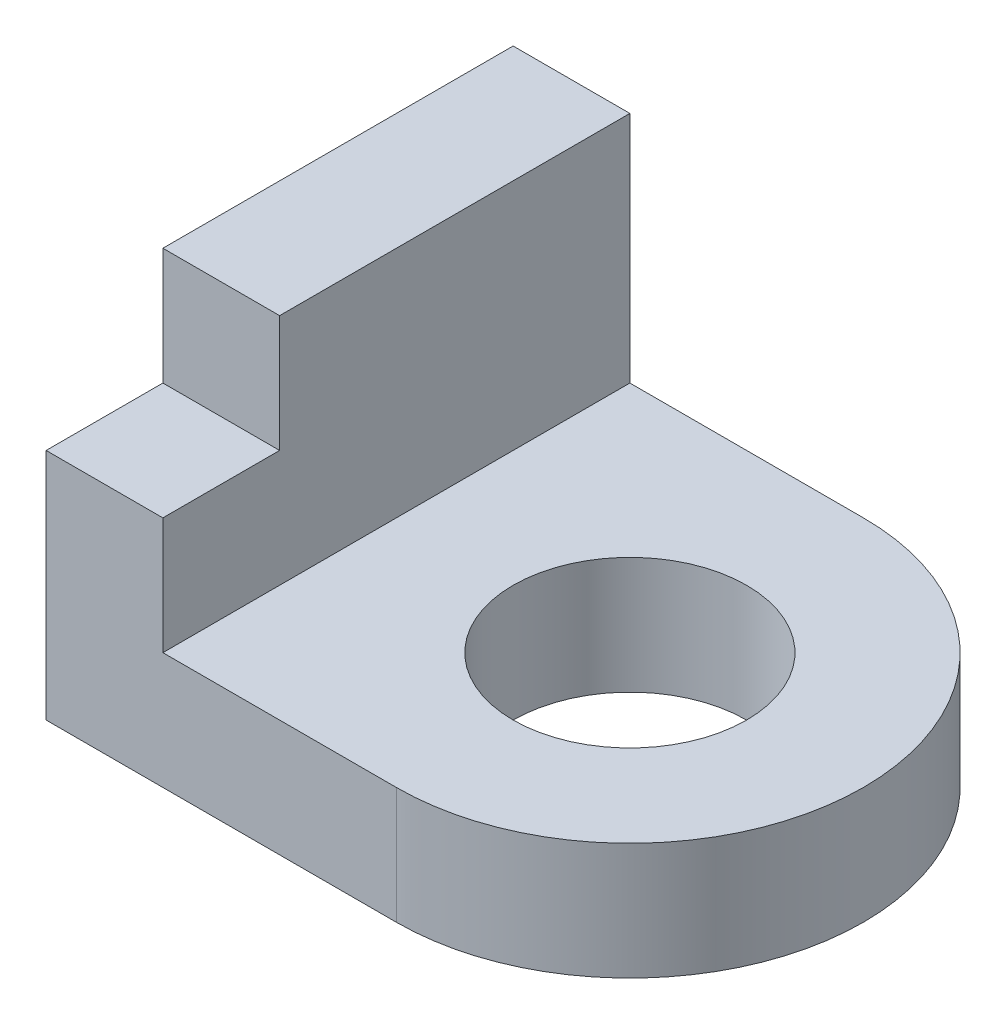
ISO-10303-21;
HEADER;
FILE_DESCRIPTION(('STEP AP214'),'2;1');
FILE_NAME('part.step','',(''),(''),'','','');
FILE_SCHEMA(('AUTOMOTIVE_DESIGN { 1 0 10303 214 1 1 1 1 }'));
ENDSEC;
DATA;
#1=APPLICATION_CONTEXT('core data for automotive mechanical design processes');
#2=APPLICATION_PROTOCOL_DEFINITION('international standard','automotive_design',2000,#1);
#3=PRODUCT_CONTEXT('',#1,'mechanical');
#4=PRODUCT('Part','Part','',(#3));
#5=PRODUCT_RELATED_PRODUCT_CATEGORY('part','',(#4));
#6=PRODUCT_DEFINITION_FORMATION('','',#4);
#7=PRODUCT_DEFINITION_CONTEXT('part definition',#1,'design');
#8=PRODUCT_DEFINITION('design','',#6,#7);
#9=PRODUCT_DEFINITION_SHAPE('','',#8);
#10=(LENGTH_UNIT() NAMED_UNIT(*) SI_UNIT(.MILLI.,.METRE.));
#11=(NAMED_UNIT(*) PLANE_ANGLE_UNIT() SI_UNIT($,.RADIAN.));
#12=(NAMED_UNIT(*) SI_UNIT($,.STERADIAN.) SOLID_ANGLE_UNIT());
#13=UNCERTAINTY_MEASURE_WITH_UNIT(LENGTH_MEASURE(1.E-05),#10,'distance_accuracy_value','');
#14=(GEOMETRIC_REPRESENTATION_CONTEXT(3) GLOBAL_UNCERTAINTY_ASSIGNED_CONTEXT((#13)) GLOBAL_UNIT_ASSIGNED_CONTEXT((#10,
#11,#12)) REPRESENTATION_CONTEXT('',''));
#15=CARTESIAN_POINT('',(0.,0.,0.));
#16=DIRECTION('',(0.,0.,1.));
#17=DIRECTION('',(1.,0.,0.));
#18=AXIS2_PLACEMENT_3D('',#15,#16,#17);
#19=CARTESIAN_POINT('',(-5.44977358018115,4.8065547779606,1.72901678330591));
#20=DIRECTION('',(0.,0.,1.));
#21=DIRECTION('',(1.,0.,0.));
#22=AXIS2_PLACEMENT_3D('',#19,#20,#21);
#23=PLANE('',#22);
#24=DIRECTION('',(-1.,0.,0.));
#25=VECTOR('',#24,1.);
#26=CARTESIAN_POINT('',(-5.44977358018115,3.8065547779606,1.72901678330591));
#27=LINE('',#26,#25);
#28=CARTESIAN_POINT('',(-5.44977358018115,3.8065547779606,1.72901678330591));
#29=VERTEX_POINT('',#28);
#30=CARTESIAN_POINT('',(-8.44977358018114,3.8065547779606,1.72901678330591));
#31=VERTEX_POINT('',#30);
#32=EDGE_CURVE('E111',#29,#31,#27,.T.);
#33=ORIENTED_EDGE('',*,*,#32,.F.);
#34=DIRECTION('',(0.,-1.,0.));
#35=VECTOR('',#34,1.);
#36=CARTESIAN_POINT('',(-5.44977358018115,4.8065547779606,1.72901678330591));
#37=LINE('',#36,#35);
#38=CARTESIAN_POINT('',(-5.44977358018115,4.8065547779606,1.72901678330591));
#39=VERTEX_POINT('',#38);
#40=EDGE_CURVE('E11',#39,#29,#37,.T.);
#41=ORIENTED_EDGE('',*,*,#40,.F.);
#42=DIRECTION('',(-1.,0.,0.));
#43=VECTOR('',#42,1.);
#44=CARTESIAN_POINT('',(-5.44977358018115,4.8065547779606,1.72901678330591));
#45=LINE('',#44,#43);
#46=CARTESIAN_POINT('',(-7.44977358018115,4.8065547779606,1.72901678330591));
#47=VERTEX_POINT('',#46);
#48=EDGE_CURVE('E101',#39,#47,#45,.T.);
#49=ORIENTED_EDGE('',*,*,#48,.T.);
#50=DIRECTION('',(0.,-1.,0.));
#51=VECTOR('',#50,1.);
#52=CARTESIAN_POINT('',(-7.44977358018115,5.8065547779606,1.72901678330591));
#53=LINE('',#52,#51);
#54=CARTESIAN_POINT('',(-7.44977358018115,5.8065547779606,1.72901678330591));
#55=VERTEX_POINT('',#54);
#56=EDGE_CURVE('E115',#55,#47,#53,.T.);
#57=ORIENTED_EDGE('',*,*,#56,.F.);
#58=DIRECTION('',(-1.,0.,0.));
#59=VECTOR('',#58,1.);
#60=CARTESIAN_POINT('',(-5.44977358018115,5.8065547779606,1.72901678330591));
#61=LINE('',#60,#59);
#62=CARTESIAN_POINT('',(-8.44977358018114,5.8065547779606,1.72901678330591));
#63=VERTEX_POINT('',#62);
#64=EDGE_CURVE('E128',#55,#63,#61,.T.);
#65=ORIENTED_EDGE('',*,*,#64,.T.);
#66=DIRECTION('',(0.,-1.,0.));
#67=VECTOR('',#66,1.);
#68=CARTESIAN_POINT('',(-8.44977358018114,5.8065547779606,1.72901678330591));
#69=LINE('',#68,#67);
#70=EDGE_CURVE('E122',#63,#31,#69,.T.);
#71=ORIENTED_EDGE('',*,*,#70,.T.);
#72=EDGE_LOOP('',(#33,#41,#49,#57,#65,#71));
#73=FACE_BOUND('',#72,.T.);
#74=ADVANCED_FACE('F38',(#73),#23,.T.);
#75=CARTESIAN_POINT('',(-5.44977358018115,4.8065547779606,-0.27098321669409));
#76=DIRECTION('',(0.,-1.,0.));
#77=DIRECTION('',(0.,0.,-1.));
#78=AXIS2_PLACEMENT_3D('',#75,#76,#77);
#79=CYLINDRICAL_SURFACE('',#78,2.);
#80=CARTESIAN_POINT('',(-5.44977358018115,3.8065547779606,-0.27098321669409));
#81=DIRECTION('',(0.,1.,0.));
#82=DIRECTION('',(0.,0.,1.));
#83=AXIS2_PLACEMENT_3D('',#80,#81,#82);
#84=CIRCLE('',#83,2.);
#85=CARTESIAN_POINT('',(-5.44977358018115,3.8065547779606,-2.27098321669409));
#86=VERTEX_POINT('',#85);
#87=EDGE_CURVE('E104',#29,#86,#84,.T.);
#88=ORIENTED_EDGE('',*,*,#87,.T.);
#89=DIRECTION('',(0.,-1.,0.));
#90=VECTOR('',#89,1.);
#91=CARTESIAN_POINT('',(-5.44977358018115,4.8065547779606,-2.27098321669409));
#92=LINE('',#91,#90);
#93=CARTESIAN_POINT('',(-5.44977358018115,4.8065547779606,-2.27098321669409));
#94=VERTEX_POINT('',#93);
#95=EDGE_CURVE('E47',#94,#86,#92,.T.);
#96=ORIENTED_EDGE('',*,*,#95,.F.);
#97=CARTESIAN_POINT('',(-5.44977358018115,4.8065547779606,-0.27098321669409));
#98=DIRECTION('',(0.,1.,0.));
#99=DIRECTION('',(0.,0.,1.));
#100=AXIS2_PLACEMENT_3D('',#97,#98,#99);
#101=CIRCLE('',#100,2.);
#102=EDGE_CURVE('E98',#39,#94,#101,.T.);
#103=ORIENTED_EDGE('',*,*,#102,.F.);
#104=ORIENTED_EDGE('',*,*,#40,.T.);
#105=EDGE_LOOP('',(#88,#96,#103,#104));
#106=FACE_BOUND('',#105,.T.);
#107=ADVANCED_FACE('F103',(#106),#79,.T.);
#108=CARTESIAN_POINT('',(-5.44977358018115,4.8065547779606,-2.27098321669409));
#109=DIRECTION('',(0.,0.,1.));
#110=DIRECTION('',(1.,0.,0.));
#111=AXIS2_PLACEMENT_3D('',#108,#109,#110);
#112=PLANE('',#111);
#113=DIRECTION('',(-1.,0.,0.));
#114=VECTOR('',#113,1.);
#115=CARTESIAN_POINT('',(-5.44977358018115,3.8065547779606,-2.27098321669409));
#116=LINE('',#115,#114);
#117=CARTESIAN_POINT('',(-8.44977358018114,3.8065547779606,-2.27098321669409));
#118=VERTEX_POINT('',#117);
#119=EDGE_CURVE('E107',#86,#118,#116,.T.);
#120=ORIENTED_EDGE('',*,*,#119,.T.);
#121=DIRECTION('',(0.,-1.,0.));
#122=VECTOR('',#121,1.);
#123=CARTESIAN_POINT('',(-8.44977358018114,6.8065547779606,-2.27098321669409));
#124=LINE('',#123,#122);
#125=CARTESIAN_POINT('',(-8.44977358018114,6.8065547779606,-2.27098321669409));
#126=VERTEX_POINT('',#125);
#127=EDGE_CURVE('E139',#126,#118,#124,.T.);
#128=ORIENTED_EDGE('',*,*,#127,.F.);
#129=DIRECTION('',(-1.,0.,0.));
#130=VECTOR('',#129,1.);
#131=CARTESIAN_POINT('',(-5.44977358018115,6.8065547779606,-2.27098321669409));
#132=LINE('',#131,#130);
#133=CARTESIAN_POINT('',(-7.44977358018115,6.8065547779606,-2.27098321669409));
#134=VERTEX_POINT('',#133);
#135=EDGE_CURVE('E154',#134,#126,#132,.T.);
#136=ORIENTED_EDGE('',*,*,#135,.F.);
#137=DIRECTION('',(0.,-1.,0.));
#138=VECTOR('',#137,1.);
#139=CARTESIAN_POINT('',(-7.44977358018115,6.8065547779606,-2.27098321669409));
#140=LINE('',#139,#138);
#141=CARTESIAN_POINT('',(-7.44977358018115,4.8065547779606,-2.27098321669409));
#142=VERTEX_POINT('',#141);
#143=EDGE_CURVE('E97',#134,#142,#140,.T.);
#144=ORIENTED_EDGE('',*,*,#143,.T.);
#145=DIRECTION('',(-1.,0.,0.));
#146=VECTOR('',#145,1.);
#147=CARTESIAN_POINT('',(-5.44977358018115,4.8065547779606,-2.27098321669409));
#148=LINE('',#147,#146);
#149=EDGE_CURVE('E90',#94,#142,#148,.T.);
#150=ORIENTED_EDGE('',*,*,#149,.F.);
#151=ORIENTED_EDGE('',*,*,#95,.T.);
#152=EDGE_LOOP('',(#120,#128,#136,#144,#150,#151));
#153=FACE_BOUND('',#152,.T.);
#154=ADVANCED_FACE('F93',(#153),#112,.F.);
#155=CARTESIAN_POINT('',(-5.44977358018115,4.8065547779606,-0.27098321669409));
#156=DIRECTION('',(0.,-1.,0.));
#157=DIRECTION('',(0.,0.,-1.));
#158=AXIS2_PLACEMENT_3D('',#155,#156,#157);
#159=CYLINDRICAL_SURFACE('',#158,1.);
#160=CARTESIAN_POINT('',(-5.44977358018115,4.8065547779606,-0.27098321669409));
#161=DIRECTION('',(0.,1.,0.));
#162=DIRECTION('',(0.,0.,1.));
#163=AXIS2_PLACEMENT_3D('',#160,#161,#162);
#164=CIRCLE('',#163,1.);
#165=CARTESIAN_POINT('',(-5.44977358018115,4.8065547779606,0.72901678330591));
#166=VERTEX_POINT('',#165);
#167=EDGE_CURVE('E109',#166,#166,#164,.T.);
#168=ORIENTED_EDGE('',*,*,#167,.T.);
#169=EDGE_LOOP('',(#168));
#170=FACE_BOUND('',#169,.T.);
#171=CARTESIAN_POINT('',(-5.44977358018115,3.8065547779606,-0.27098321669409));
#172=DIRECTION('',(0.,1.,0.));
#173=DIRECTION('',(0.,0.,1.));
#174=AXIS2_PLACEMENT_3D('',#171,#172,#173);
#175=CIRCLE('',#174,1.);
#176=CARTESIAN_POINT('',(-5.44977358018115,3.8065547779606,0.72901678330591));
#177=VERTEX_POINT('',#176);
#178=EDGE_CURVE('E113',#177,#177,#175,.T.);
#179=ORIENTED_EDGE('',*,*,#178,.F.);
#180=EDGE_LOOP('',(#179));
#181=FACE_BOUND('',#180,.T.);
#182=ADVANCED_FACE('F40',(#170,#181),#159,.F.);
#183=CARTESIAN_POINT('',(-5.44977358018115,4.8065547779606,-0.27098321669409));
#184=DIRECTION('',(0.,1.,0.));
#185=DIRECTION('',(0.,0.,1.));
#186=AXIS2_PLACEMENT_3D('',#183,#184,#185);
#187=PLANE('',#186);
#188=ORIENTED_EDGE('',*,*,#167,.F.);
#189=EDGE_LOOP('',(#188));
#190=FACE_BOUND('',#189,.T.);
#191=ORIENTED_EDGE('',*,*,#48,.F.);
#192=ORIENTED_EDGE('',*,*,#102,.T.);
#193=ORIENTED_EDGE('',*,*,#149,.T.);
#194=DIRECTION('',(0.,0.,1.));
#195=VECTOR('',#194,1.);
#196=CARTESIAN_POINT('',(-7.44977358018115,4.8065547779606,-0.27098321669409));
#197=LINE('',#196,#195);
#198=EDGE_CURVE('E55',#142,#47,#197,.T.);
#199=ORIENTED_EDGE('',*,*,#198,.T.);
#200=EDGE_LOOP('',(#191,#192,#193,#199));
#201=FACE_BOUND('',#200,.T.);
#202=ADVANCED_FACE('F100',(#190,#201),#187,.T.);
#203=CARTESIAN_POINT('',(-5.44977358018115,3.8065547779606,-0.27098321669409));
#204=DIRECTION('',(0.,1.,0.));
#205=DIRECTION('',(0.,0.,1.));
#206=AXIS2_PLACEMENT_3D('',#203,#204,#205);
#207=PLANE('',#206);
#208=ORIENTED_EDGE('',*,*,#178,.T.);
#209=EDGE_LOOP('',(#208));
#210=FACE_BOUND('',#209,.T.);
#211=ORIENTED_EDGE('',*,*,#32,.T.);
#212=DIRECTION('',(0.,0.,1.));
#213=VECTOR('',#212,1.);
#214=CARTESIAN_POINT('',(-8.44977358018114,3.8065547779606,-0.27098321669409));
#215=LINE('',#214,#213);
#216=EDGE_CURVE('E125',#118,#31,#215,.T.);
#217=ORIENTED_EDGE('',*,*,#216,.F.);
#218=ORIENTED_EDGE('',*,*,#119,.F.);
#219=ORIENTED_EDGE('',*,*,#87,.F.);
#220=EDGE_LOOP('',(#211,#217,#218,#219));
#221=FACE_BOUND('',#220,.T.);
#222=ADVANCED_FACE('F203',(#210,#221),#207,.F.);
#223=CARTESIAN_POINT('',(-7.44977358018115,5.8065547779606,-0.27098321669409));
#224=DIRECTION('',(-1.,0.,0.));
#225=DIRECTION('',(0.,0.,1.));
#226=AXIS2_PLACEMENT_3D('',#223,#224,#225);
#227=PLANE('',#226);
#228=ORIENTED_EDGE('',*,*,#56,.T.);
#229=ORIENTED_EDGE('',*,*,#198,.F.);
#230=ORIENTED_EDGE('',*,*,#143,.F.);
#231=DIRECTION('',(0.,0.,1.));
#232=VECTOR('',#231,1.);
#233=CARTESIAN_POINT('',(-7.44977358018115,6.8065547779606,-0.27098321669409));
#234=LINE('',#233,#232);
#235=CARTESIAN_POINT('',(-7.44977358018115,6.8065547779606,0.729016783305911));
#236=VERTEX_POINT('',#235);
#237=EDGE_CURVE('E157',#134,#236,#234,.T.);
#238=ORIENTED_EDGE('',*,*,#237,.T.);
#239=DIRECTION('',(0.,-1.,0.));
#240=VECTOR('',#239,1.);
#241=CARTESIAN_POINT('',(-7.44977358018115,6.8065547779606,0.729016783305911));
#242=LINE('',#241,#240);
#243=CARTESIAN_POINT('',(-7.44977358018115,5.8065547779606,0.729016783305911));
#244=VERTEX_POINT('',#243);
#245=EDGE_CURVE('E145',#236,#244,#242,.T.);
#246=ORIENTED_EDGE('',*,*,#245,.T.);
#247=DIRECTION('',(0.,0.,-1.));
#248=VECTOR('',#247,1.);
#249=CARTESIAN_POINT('',(-7.44977358018115,5.8065547779606,-0.27098321669409));
#250=LINE('',#249,#248);
#251=EDGE_CURVE('E133',#55,#244,#250,.T.);
#252=ORIENTED_EDGE('',*,*,#251,.F.);
#253=EDGE_LOOP('',(#228,#229,#230,#238,#246,#252));
#254=FACE_BOUND('',#253,.T.);
#255=ADVANCED_FACE('F162',(#254),#227,.F.);
#256=CARTESIAN_POINT('',(-8.44977358018114,5.8065547779606,-0.27098321669409));
#257=DIRECTION('',(1.,0.,0.));
#258=DIRECTION('',(0.,0.,-1.));
#259=AXIS2_PLACEMENT_3D('',#256,#257,#258);
#260=PLANE('',#259);
#261=ORIENTED_EDGE('',*,*,#216,.T.);
#262=ORIENTED_EDGE('',*,*,#70,.F.);
#263=DIRECTION('',(0.,0.,1.));
#264=VECTOR('',#263,1.);
#265=CARTESIAN_POINT('',(-8.44977358018114,5.8065547779606,-0.27098321669409));
#266=LINE('',#265,#264);
#267=CARTESIAN_POINT('',(-8.44977358018114,5.8065547779606,0.729016783305911));
#268=VERTEX_POINT('',#267);
#269=EDGE_CURVE('E76',#268,#63,#266,.T.);
#270=ORIENTED_EDGE('',*,*,#269,.F.);
#271=DIRECTION('',(0.,-1.,0.));
#272=VECTOR('',#271,1.);
#273=CARTESIAN_POINT('',(-8.44977358018114,6.8065547779606,0.729016783305911));
#274=LINE('',#273,#272);
#275=CARTESIAN_POINT('',(-8.44977358018114,6.8065547779606,0.729016783305911));
#276=VERTEX_POINT('',#275);
#277=EDGE_CURVE('E142',#276,#268,#274,.T.);
#278=ORIENTED_EDGE('',*,*,#277,.F.);
#279=DIRECTION('',(0.,0.,1.));
#280=VECTOR('',#279,1.);
#281=CARTESIAN_POINT('',(-8.44977358018114,6.8065547779606,-0.27098321669409));
#282=LINE('',#281,#280);
#283=EDGE_CURVE('E151',#126,#276,#282,.T.);
#284=ORIENTED_EDGE('',*,*,#283,.F.);
#285=ORIENTED_EDGE('',*,*,#127,.T.);
#286=EDGE_LOOP('',(#261,#262,#270,#278,#284,#285));
#287=FACE_BOUND('',#286,.T.);
#288=ADVANCED_FACE('F185',(#287),#260,.F.);
#289=CARTESIAN_POINT('',(-5.44977358018115,5.8065547779606,-0.27098321669409));
#290=DIRECTION('',(0.,1.,0.));
#291=DIRECTION('',(0.,0.,1.));
#292=AXIS2_PLACEMENT_3D('',#289,#290,#291);
#293=PLANE('',#292);
#294=ORIENTED_EDGE('',*,*,#64,.F.);
#295=ORIENTED_EDGE('',*,*,#251,.T.);
#296=DIRECTION('',(1.,0.,0.));
#297=VECTOR('',#296,1.);
#298=CARTESIAN_POINT('',(-5.44977358018115,5.8065547779606,0.729016783305911));
#299=LINE('',#298,#297);
#300=EDGE_CURVE('E130',#268,#244,#299,.T.);
#301=ORIENTED_EDGE('',*,*,#300,.F.);
#302=ORIENTED_EDGE('',*,*,#269,.T.);
#303=EDGE_LOOP('',(#294,#295,#301,#302));
#304=FACE_BOUND('',#303,.T.);
#305=ADVANCED_FACE('F182',(#304),#293,.T.);
#306=CARTESIAN_POINT('',(-5.44977358018115,6.8065547779606,0.729016783305911));
#307=DIRECTION('',(0.,0.,-1.));
#308=DIRECTION('',(-1.,0.,0.));
#309=AXIS2_PLACEMENT_3D('',#306,#307,#308);
#310=PLANE('',#309);
#311=ORIENTED_EDGE('',*,*,#300,.T.);
#312=ORIENTED_EDGE('',*,*,#245,.F.);
#313=DIRECTION('',(1.,0.,0.));
#314=VECTOR('',#313,1.);
#315=CARTESIAN_POINT('',(-5.44977358018115,6.8065547779606,0.729016783305911));
#316=LINE('',#315,#314);
#317=EDGE_CURVE('E148',#276,#236,#316,.T.);
#318=ORIENTED_EDGE('',*,*,#317,.F.);
#319=ORIENTED_EDGE('',*,*,#277,.T.);
#320=EDGE_LOOP('',(#311,#312,#318,#319));
#321=FACE_BOUND('',#320,.T.);
#322=ADVANCED_FACE('F184',(#321),#310,.F.);
#323=CARTESIAN_POINT('',(-5.44977358018115,6.8065547779606,-0.27098321669409));
#324=DIRECTION('',(0.,1.,0.));
#325=DIRECTION('',(0.,0.,1.));
#326=AXIS2_PLACEMENT_3D('',#323,#324,#325);
#327=PLANE('',#326);
#328=ORIENTED_EDGE('',*,*,#237,.F.);
#329=ORIENTED_EDGE('',*,*,#135,.T.);
#330=ORIENTED_EDGE('',*,*,#283,.T.);
#331=ORIENTED_EDGE('',*,*,#317,.T.);
#332=EDGE_LOOP('',(#328,#329,#330,#331));
#333=FACE_BOUND('',#332,.T.);
#334=ADVANCED_FACE('F169',(#333),#327,.T.);
#335=CLOSED_SHELL('',(#74,#107,#154,#182,#202,#222,#255,#288,#305,#322,#334));
#336=MANIFOLD_SOLID_BREP('B2',#335);
#337=ADVANCED_BREP_SHAPE_REPRESENTATION('',(#18,#336),#14);
#338=SHAPE_DEFINITION_REPRESENTATION(#9,#337);
ENDSEC;
END-ISO-10303-21;
